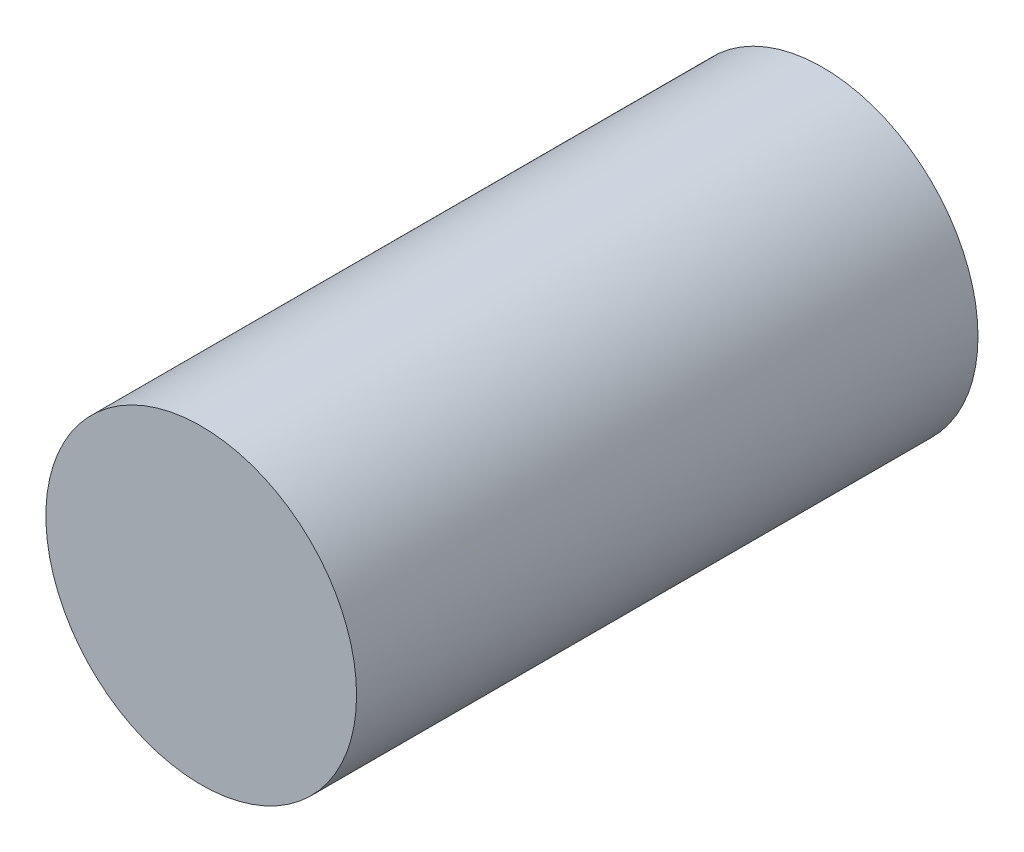
ISO-10303-21;
HEADER;
FILE_DESCRIPTION(('STEP AP214'),'2;1');
FILE_NAME('part.step','',(''),(''),'','','');
FILE_SCHEMA(('AUTOMOTIVE_DESIGN { 1 0 10303 214 1 1 1 1 }'));
ENDSEC;
DATA;
#1=APPLICATION_CONTEXT('core data for automotive mechanical design processes');
#2=APPLICATION_PROTOCOL_DEFINITION('international standard','automotive_design',2000,#1);
#3=PRODUCT_CONTEXT('',#1,'mechanical');
#4=PRODUCT('Part','Part','',(#3));
#5=PRODUCT_RELATED_PRODUCT_CATEGORY('part','',(#4));
#6=PRODUCT_DEFINITION_FORMATION('','',#4);
#7=PRODUCT_DEFINITION_CONTEXT('part definition',#1,'design');
#8=PRODUCT_DEFINITION('design','',#6,#7);
#9=PRODUCT_DEFINITION_SHAPE('','',#8);
#10=(LENGTH_UNIT() NAMED_UNIT(*) SI_UNIT(.MILLI.,.METRE.));
#11=(NAMED_UNIT(*) PLANE_ANGLE_UNIT() SI_UNIT($,.RADIAN.));
#12=(NAMED_UNIT(*) SI_UNIT($,.STERADIAN.) SOLID_ANGLE_UNIT());
#13=UNCERTAINTY_MEASURE_WITH_UNIT(LENGTH_MEASURE(1.E-05),#10,'distance_accuracy_value','');
#14=(GEOMETRIC_REPRESENTATION_CONTEXT(3) GLOBAL_UNCERTAINTY_ASSIGNED_CONTEXT((#13)) GLOBAL_UNIT_ASSIGNED_CONTEXT((#10,
#11,#12)) REPRESENTATION_CONTEXT('',''));
#15=CARTESIAN_POINT('',(0.,0.,0.));
#16=DIRECTION('',(0.,0.,1.));
#17=DIRECTION('',(1.,0.,0.));
#18=AXIS2_PLACEMENT_3D('',#15,#16,#17);
#19=CARTESIAN_POINT('',(0.,0.,2.));
#20=DIRECTION('',(0.,0.,-1.));
#21=DIRECTION('',(-1.,0.,0.));
#22=AXIS2_PLACEMENT_3D('',#19,#20,#21);
#23=CYLINDRICAL_SURFACE('',#22,0.5);
#24=CARTESIAN_POINT('',(0.,0.,2.));
#25=DIRECTION('',(0.,0.,1.));
#26=DIRECTION('',(1.,0.,0.));
#27=AXIS2_PLACEMENT_3D('',#24,#25,#26);
#28=CIRCLE('',#27,0.5);
#29=CARTESIAN_POINT('',(0.5,0.,2.));
#30=VERTEX_POINT('',#29);
#31=EDGE_CURVE('E10',#30,#30,#28,.T.);
#32=ORIENTED_EDGE('',*,*,#31,.F.);
#33=EDGE_LOOP('',(#32));
#34=FACE_BOUND('',#33,.T.);
#35=CARTESIAN_POINT('',(0.,0.,0.));
#36=DIRECTION('',(0.,0.,1.));
#37=DIRECTION('',(1.,0.,0.));
#38=AXIS2_PLACEMENT_3D('',#35,#36,#37);
#39=CIRCLE('',#38,0.5);
#40=CARTESIAN_POINT('',(0.5,0.,0.));
#41=VERTEX_POINT('',#40);
#42=EDGE_CURVE('E37',#41,#41,#39,.T.);
#43=ORIENTED_EDGE('',*,*,#42,.T.);
#44=EDGE_LOOP('',(#43));
#45=FACE_BOUND('',#44,.T.);
#46=ADVANCED_FACE('F34',(#34,#45),#23,.T.);
#47=CARTESIAN_POINT('',(0.,0.,2.));
#48=DIRECTION('',(0.,0.,1.));
#49=DIRECTION('',(1.,0.,0.));
#50=AXIS2_PLACEMENT_3D('',#47,#48,#49);
#51=PLANE('',#50);
#52=ORIENTED_EDGE('',*,*,#31,.T.);
#53=EDGE_LOOP('',(#52));
#54=FACE_BOUND('',#53,.T.);
#55=ADVANCED_FACE('F49',(#54),#51,.T.);
#56=CARTESIAN_POINT('',(0.,0.,0.));
#57=DIRECTION('',(0.,0.,1.));
#58=DIRECTION('',(1.,0.,0.));
#59=AXIS2_PLACEMENT_3D('',#56,#57,#58);
#60=PLANE('',#59);
#61=ORIENTED_EDGE('',*,*,#42,.F.);
#62=EDGE_LOOP('',(#61));
#63=FACE_BOUND('',#62,.T.);
#64=ADVANCED_FACE('F47',(#63),#60,.F.);
#65=CLOSED_SHELL('',(#46,#55,#64));
#66=MANIFOLD_SOLID_BREP('B2',#65);
#67=ADVANCED_BREP_SHAPE_REPRESENTATION('',(#18,#66),#14);
#68=SHAPE_DEFINITION_REPRESENTATION(#9,#67);
ENDSEC;
END-ISO-10303-21;
